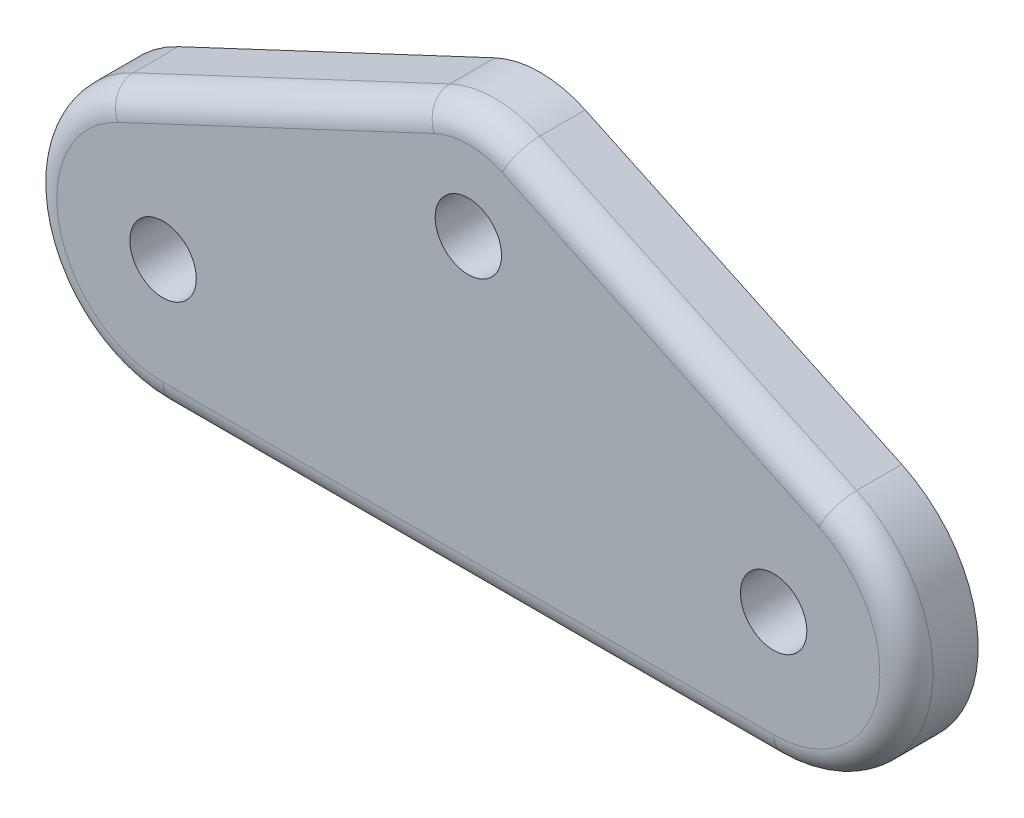
ISO-10303-21;
HEADER;
FILE_DESCRIPTION(('STEP AP214'),'2;1');
FILE_NAME('part.step','',(''),(''),'','','');
FILE_SCHEMA(('AUTOMOTIVE_DESIGN { 1 0 10303 214 1 1 1 1 }'));
ENDSEC;
DATA;
#1=APPLICATION_CONTEXT('core data for automotive mechanical design processes');
#2=APPLICATION_PROTOCOL_DEFINITION('international standard','automotive_design',2000,#1);
#3=PRODUCT_CONTEXT('',#1,'mechanical');
#4=PRODUCT('Part','Part','',(#3));
#5=PRODUCT_RELATED_PRODUCT_CATEGORY('part','',(#4));
#6=PRODUCT_DEFINITION_FORMATION('','',#4);
#7=PRODUCT_DEFINITION_CONTEXT('part definition',#1,'design');
#8=PRODUCT_DEFINITION('design','',#6,#7);
#9=PRODUCT_DEFINITION_SHAPE('','',#8);
#10=(LENGTH_UNIT() NAMED_UNIT(*) SI_UNIT(.MILLI.,.METRE.));
#11=(NAMED_UNIT(*) PLANE_ANGLE_UNIT() SI_UNIT($,.RADIAN.));
#12=(NAMED_UNIT(*) SI_UNIT($,.STERADIAN.) SOLID_ANGLE_UNIT());
#13=UNCERTAINTY_MEASURE_WITH_UNIT(LENGTH_MEASURE(1.E-05),#10,'distance_accuracy_value','');
#14=(GEOMETRIC_REPRESENTATION_CONTEXT(3) GLOBAL_UNCERTAINTY_ASSIGNED_CONTEXT((#13)) GLOBAL_UNIT_ASSIGNED_CONTEXT((#10,
#11,#12)) REPRESENTATION_CONTEXT('',''));
#15=CARTESIAN_POINT('',(0.,0.,0.));
#16=DIRECTION('',(0.,0.,1.));
#17=DIRECTION('',(1.,0.,0.));
#18=AXIS2_PLACEMENT_3D('',#15,#16,#17);
#19=CARTESIAN_POINT('',(-14.5937242344204,0.,3.429));
#20=DIRECTION('',(0.,0.,-1.));
#21=DIRECTION('',(-1.,0.,0.));
#22=AXIS2_PLACEMENT_3D('',#19,#20,#21);
#23=CYLINDRICAL_SURFACE('',#22,6.35);
#24=DIRECTION('',(0.,0.,-1.));
#25=VECTOR('',#24,1.);
#26=CARTESIAN_POINT('',(-14.5937242344204,-6.35,3.429));
#27=LINE('',#26,#25);
#28=CARTESIAN_POINT('',(-14.5937242344204,-6.35,2.159));
#29=VERTEX_POINT('',#28);
#30=CARTESIAN_POINT('',(-14.5937242344204,-6.35,0.));
#31=VERTEX_POINT('',#30);
#32=EDGE_CURVE('E102',#29,#31,#27,.T.);
#33=ORIENTED_EDGE('',*,*,#32,.F.);
#34=CARTESIAN_POINT('',(-14.5937242344204,0.,2.159));
#35=DIRECTION('',(0.,0.,1.));
#36=DIRECTION('',(1.,0.,0.));
#37=AXIS2_PLACEMENT_3D('',#34,#35,#36);
#38=CIRCLE('',#37,6.35);
#39=CARTESIAN_POINT('',(-17.2924874025021,5.74797158679526,2.159));
#40=VERTEX_POINT('',#39);
#41=EDGE_CURVE('E41',#29,#40,#38,.F.);
#42=ORIENTED_EDGE('',*,*,#41,.T.);
#43=DIRECTION('',(0.,0.,-1.));
#44=VECTOR('',#43,1.);
#45=CARTESIAN_POINT('',(-17.2924874025021,5.74797158679526,3.429));
#46=LINE('',#45,#44);
#47=CARTESIAN_POINT('',(-17.2924874025021,5.74797158679526,0.));
#48=VERTEX_POINT('',#47);
#49=EDGE_CURVE('E121',#40,#48,#46,.T.);
#50=ORIENTED_EDGE('',*,*,#49,.T.);
#51=CARTESIAN_POINT('',(-14.5937242344204,0.,0.));
#52=DIRECTION('',(0.,0.,1.));
#53=DIRECTION('',(1.,0.,0.));
#54=AXIS2_PLACEMENT_3D('',#51,#52,#53);
#55=CIRCLE('',#54,6.35);
#56=EDGE_CURVE('E116',#48,#31,#55,.T.);
#57=ORIENTED_EDGE('',*,*,#56,.T.);
#58=EDGE_LOOP('',(#33,#42,#50,#57));
#59=FACE_BOUND('',#58,.T.);
#60=ADVANCED_FACE('F32',(#59),#23,.T.);
#61=CARTESIAN_POINT('',(14.5937242344204,-6.35,3.429));
#62=DIRECTION('',(0.,1.,0.));
#63=DIRECTION('',(0.,0.,1.));
#64=AXIS2_PLACEMENT_3D('',#61,#62,#63);
#65=PLANE('',#64);
#66=DIRECTION('',(0.,0.,-1.));
#67=VECTOR('',#66,1.);
#68=CARTESIAN_POINT('',(14.5937242344204,-6.35,3.429));
#69=LINE('',#68,#67);
#70=CARTESIAN_POINT('',(14.5937242344204,-6.35,2.159));
#71=VERTEX_POINT('',#70);
#72=CARTESIAN_POINT('',(14.5937242344204,-6.35,0.));
#73=VERTEX_POINT('',#72);
#74=EDGE_CURVE('E110',#71,#73,#69,.T.);
#75=ORIENTED_EDGE('',*,*,#74,.F.);
#76=DIRECTION('',(1.,0.,0.));
#77=VECTOR('',#76,1.);
#78=CARTESIAN_POINT('',(-14.5937242344204,-6.35,2.159));
#79=LINE('',#78,#77);
#80=EDGE_CURVE('E56',#71,#29,#79,.F.);
#81=ORIENTED_EDGE('',*,*,#80,.T.);
#82=ORIENTED_EDGE('',*,*,#32,.T.);
#83=DIRECTION('',(1.,0.,0.));
#84=VECTOR('',#83,1.);
#85=CARTESIAN_POINT('',(14.5937242344204,-6.35,0.));
#86=LINE('',#85,#84);
#87=EDGE_CURVE('E105',#31,#73,#86,.T.);
#88=ORIENTED_EDGE('',*,*,#87,.T.);
#89=EDGE_LOOP('',(#75,#81,#82,#88));
#90=FACE_BOUND('',#89,.T.);
#91=ADVANCED_FACE('F104',(#90),#65,.F.);
#92=CARTESIAN_POINT('',(14.5937242344204,0.,3.429));
#93=DIRECTION('',(0.,0.,-1.));
#94=DIRECTION('',(-1.,0.,0.));
#95=AXIS2_PLACEMENT_3D('',#92,#93,#94);
#96=CYLINDRICAL_SURFACE('',#95,6.35);
#97=DIRECTION('',(0.,0.,-1.));
#98=VECTOR('',#97,1.);
#99=CARTESIAN_POINT('',(17.2924874025021,5.74797158679526,3.429));
#100=LINE('',#99,#98);
#101=CARTESIAN_POINT('',(17.2924874025021,5.74797158679526,2.159));
#102=VERTEX_POINT('',#101);
#103=CARTESIAN_POINT('',(17.2924874025021,5.74797158679526,0.));
#104=VERTEX_POINT('',#103);
#105=EDGE_CURVE('E144',#102,#104,#100,.T.);
#106=ORIENTED_EDGE('',*,*,#105,.F.);
#107=CARTESIAN_POINT('',(14.5937242344204,0.,2.159));
#108=DIRECTION('',(0.,0.,1.));
#109=DIRECTION('',(1.,0.,0.));
#110=AXIS2_PLACEMENT_3D('',#107,#108,#109);
#111=CIRCLE('',#110,6.35);
#112=EDGE_CURVE('E164',#102,#71,#111,.F.);
#113=ORIENTED_EDGE('',*,*,#112,.T.);
#114=ORIENTED_EDGE('',*,*,#74,.T.);
#115=CARTESIAN_POINT('',(14.5937242344204,0.,0.));
#116=DIRECTION('',(0.,0.,1.));
#117=DIRECTION('',(1.,0.,0.));
#118=AXIS2_PLACEMENT_3D('',#115,#116,#117);
#119=CIRCLE('',#118,6.35);
#120=EDGE_CURVE('E119',#73,#104,#119,.T.);
#121=ORIENTED_EDGE('',*,*,#120,.T.);
#122=EDGE_LOOP('',(#106,#113,#114,#121));
#123=FACE_BOUND('',#122,.T.);
#124=ADVANCED_FACE('F215',(#123),#96,.T.);
#125=CARTESIAN_POINT('',(2.15901053446535,12.8533772694362,3.429));
#126=DIRECTION('',(-0.425002073713651,-0.90519237587327,0.));
#127=DIRECTION('',(0.90519237587327,-0.425002073713651,0.));
#128=AXIS2_PLACEMENT_3D('',#125,#126,#127);
#129=PLANE('',#128);
#130=DIRECTION('',(0.,0.,-1.));
#131=VECTOR('',#130,1.);
#132=CARTESIAN_POINT('',(2.15901053446535,12.8533772694362,3.429));
#133=LINE('',#132,#131);
#134=CARTESIAN_POINT('',(2.15901053446535,12.8533772694362,2.159));
#135=VERTEX_POINT('',#134);
#136=CARTESIAN_POINT('',(2.15901053446535,12.8533772694362,0.));
#137=VERTEX_POINT('',#136);
#138=EDGE_CURVE('E142',#135,#137,#133,.T.);
#139=ORIENTED_EDGE('',*,*,#138,.F.);
#140=DIRECTION('',(-0.90519237587327,0.425002073713651,0.));
#141=VECTOR('',#140,1.);
#142=CARTESIAN_POINT('',(17.2924874025021,5.74797158679526,2.159));
#143=LINE('',#142,#141);
#144=EDGE_CURVE('E162',#135,#102,#143,.F.);
#145=ORIENTED_EDGE('',*,*,#144,.T.);
#146=ORIENTED_EDGE('',*,*,#105,.T.);
#147=DIRECTION('',(-0.90519237587327,0.425002073713651,0.));
#148=VECTOR('',#147,1.);
#149=CARTESIAN_POINT('',(2.15901053446535,12.8533772694362,0.));
#150=LINE('',#149,#148);
#151=EDGE_CURVE('E131',#104,#137,#150,.T.);
#152=ORIENTED_EDGE('',*,*,#151,.T.);
#153=EDGE_LOOP('',(#139,#145,#146,#152));
#154=FACE_BOUND('',#153,.T.);
#155=ADVANCED_FACE('F212',(#154),#129,.F.);
#156=CARTESIAN_POINT('',(0.,8.255,3.429));
#157=DIRECTION('',(0.,0.,-1.));
#158=DIRECTION('',(-1.,0.,0.));
#159=AXIS2_PLACEMENT_3D('',#156,#157,#158);
#160=CYLINDRICAL_SURFACE('',#159,5.08);
#161=DIRECTION('',(0.,0.,-1.));
#162=VECTOR('',#161,1.);
#163=CARTESIAN_POINT('',(-2.15901053446535,12.8533772694362,3.429));
#164=LINE('',#163,#162);
#165=CARTESIAN_POINT('',(-2.15901053446535,12.8533772694362,2.159));
#166=VERTEX_POINT('',#165);
#167=CARTESIAN_POINT('',(-2.15901053446535,12.8533772694362,0.));
#168=VERTEX_POINT('',#167);
#169=EDGE_CURVE('E140',#166,#168,#164,.T.);
#170=ORIENTED_EDGE('',*,*,#169,.F.);
#171=CARTESIAN_POINT('',(0.,8.255,2.159));
#172=DIRECTION('',(0.,0.,1.));
#173=DIRECTION('',(1.,0.,0.));
#174=AXIS2_PLACEMENT_3D('',#171,#172,#173);
#175=CIRCLE('',#174,5.08);
#176=EDGE_CURVE('E159',#166,#135,#175,.F.);
#177=ORIENTED_EDGE('',*,*,#176,.T.);
#178=ORIENTED_EDGE('',*,*,#138,.T.);
#179=CARTESIAN_POINT('',(0.,8.255,0.));
#180=DIRECTION('',(0.,0.,1.));
#181=DIRECTION('',(-1.,0.,0.));
#182=AXIS2_PLACEMENT_3D('',#179,#180,#181);
#183=CIRCLE('',#182,5.08);
#184=EDGE_CURVE('E134',#137,#168,#183,.T.);
#185=ORIENTED_EDGE('',*,*,#184,.T.);
#186=EDGE_LOOP('',(#170,#177,#178,#185));
#187=FACE_BOUND('',#186,.T.);
#188=ADVANCED_FACE('F200',(#187),#160,.T.);
#189=CARTESIAN_POINT('',(-17.2924874025021,5.74797158679526,3.429));
#190=DIRECTION('',(0.425002073713651,-0.90519237587327,0.));
#191=DIRECTION('',(0.90519237587327,0.425002073713651,0.));
#192=AXIS2_PLACEMENT_3D('',#189,#190,#191);
#193=PLANE('',#192);
#194=ORIENTED_EDGE('',*,*,#49,.F.);
#195=DIRECTION('',(-0.90519237587327,-0.425002073713651,0.));
#196=VECTOR('',#195,1.);
#197=CARTESIAN_POINT('',(-2.15901053446535,12.8533772694362,2.159));
#198=LINE('',#197,#196);
#199=EDGE_CURVE('E11',#40,#166,#198,.F.);
#200=ORIENTED_EDGE('',*,*,#199,.T.);
#201=ORIENTED_EDGE('',*,*,#169,.T.);
#202=DIRECTION('',(-0.90519237587327,-0.425002073713651,0.));
#203=VECTOR('',#202,1.);
#204=CARTESIAN_POINT('',(-17.2924874025021,5.74797158679526,0.));
#205=LINE('',#204,#203);
#206=EDGE_CURVE('E137',#168,#48,#205,.T.);
#207=ORIENTED_EDGE('',*,*,#206,.T.);
#208=EDGE_LOOP('',(#194,#200,#201,#207));
#209=FACE_BOUND('',#208,.T.);
#210=ADVANCED_FACE('F197',(#209),#193,.F.);
#211=CARTESIAN_POINT('',(-14.5937242344204,0.,3.429));
#212=DIRECTION('',(0.,0.,1.));
#213=DIRECTION('',(1.,0.,0.));
#214=AXIS2_PLACEMENT_3D('',#211,#212,#213);
#215=PLANE('',#214);
#216=CARTESIAN_POINT('',(0.,8.255,3.429));
#217=DIRECTION('',(0.,0.,1.));
#218=DIRECTION('',(1.,0.,0.));
#219=AXIS2_PLACEMENT_3D('',#216,#217,#218);
#220=CIRCLE('',#219,1.5875);
#221=CARTESIAN_POINT('',(1.5875,8.255,3.429));
#222=VERTEX_POINT('',#221);
#223=EDGE_CURVE('E363',#222,#222,#220,.T.);
#224=ORIENTED_EDGE('',*,*,#223,.F.);
#225=EDGE_LOOP('',(#224));
#226=FACE_BOUND('',#225,.T.);
#227=CARTESIAN_POINT('',(-14.5937242344204,0.,3.429));
#228=DIRECTION('',(0.,0.,1.));
#229=DIRECTION('',(1.,0.,0.));
#230=AXIS2_PLACEMENT_3D('',#227,#228,#229);
#231=CIRCLE('',#230,1.5875);
#232=CARTESIAN_POINT('',(-13.0062242344204,0.,3.429));
#233=VERTEX_POINT('',#232);
#234=EDGE_CURVE('E367',#233,#233,#231,.T.);
#235=ORIENTED_EDGE('',*,*,#234,.F.);
#236=EDGE_LOOP('',(#235));
#237=FACE_BOUND('',#236,.T.);
#238=CARTESIAN_POINT('',(14.5937242344204,0.,3.429));
#239=DIRECTION('',(0.,0.,1.));
#240=DIRECTION('',(1.,0.,0.));
#241=AXIS2_PLACEMENT_3D('',#238,#239,#240);
#242=CIRCLE('',#241,1.5875);
#243=CARTESIAN_POINT('',(16.1812242344204,0.,3.429));
#244=VERTEX_POINT('',#243);
#245=EDGE_CURVE('E370',#244,#244,#242,.T.);
#246=ORIENTED_EDGE('',*,*,#245,.F.);
#247=EDGE_LOOP('',(#246));
#248=FACE_BOUND('',#247,.T.);
#249=DIRECTION('',(-0.90519237587327,0.425002073713651,0.));
#250=VECTOR('',#249,1.);
#251=CARTESIAN_POINT('',(1.61925790084901,11.7037829520772,3.429));
#252=LINE('',#251,#250);
#253=CARTESIAN_POINT('',(16.7527347688858,4.59837726943621,3.429));
#254=VERTEX_POINT('',#253);
#255=CARTESIAN_POINT('',(1.61925790084901,11.7037829520772,3.429));
#256=VERTEX_POINT('',#255);
#257=EDGE_CURVE('E154',#254,#256,#252,.T.);
#258=ORIENTED_EDGE('',*,*,#257,.T.);
#259=CARTESIAN_POINT('',(0.,8.255,3.429));
#260=DIRECTION('',(0.,0.,1.));
#261=DIRECTION('',(1.,0.,0.));
#262=AXIS2_PLACEMENT_3D('',#259,#260,#261);
#263=CIRCLE('',#262,3.81);
#264=CARTESIAN_POINT('',(-1.61925790084901,11.7037829520772,3.429));
#265=VERTEX_POINT('',#264);
#266=EDGE_CURVE('E156',#256,#265,#263,.T.);
#267=ORIENTED_EDGE('',*,*,#266,.T.);
#268=DIRECTION('',(-0.90519237587327,-0.425002073713651,0.));
#269=VECTOR('',#268,1.);
#270=CARTESIAN_POINT('',(-16.7527347688858,4.59837726943621,3.429));
#271=LINE('',#270,#269);
#272=CARTESIAN_POINT('',(-16.7527347688858,4.59837726943621,3.429));
#273=VERTEX_POINT('',#272);
#274=EDGE_CURVE('E109',#265,#273,#271,.T.);
#275=ORIENTED_EDGE('',*,*,#274,.T.);
#276=CARTESIAN_POINT('',(-14.5937242344204,0.,3.429));
#277=DIRECTION('',(0.,0.,1.));
#278=DIRECTION('',(1.,0.,0.));
#279=AXIS2_PLACEMENT_3D('',#276,#277,#278);
#280=CIRCLE('',#279,5.08);
#281=CARTESIAN_POINT('',(-14.5937242344204,-5.08,3.429));
#282=VERTEX_POINT('',#281);
#283=EDGE_CURVE('E148',#273,#282,#280,.T.);
#284=ORIENTED_EDGE('',*,*,#283,.T.);
#285=DIRECTION('',(1.,0.,0.));
#286=VECTOR('',#285,1.);
#287=CARTESIAN_POINT('',(14.5937242344204,-5.08,3.429));
#288=LINE('',#287,#286);
#289=CARTESIAN_POINT('',(14.5937242344204,-5.08,3.429));
#290=VERTEX_POINT('',#289);
#291=EDGE_CURVE('E150',#282,#290,#288,.T.);
#292=ORIENTED_EDGE('',*,*,#291,.T.);
#293=CARTESIAN_POINT('',(14.5937242344204,0.,3.429));
#294=DIRECTION('',(0.,0.,1.));
#295=DIRECTION('',(1.,0.,0.));
#296=AXIS2_PLACEMENT_3D('',#293,#294,#295);
#297=CIRCLE('',#296,5.08);
#298=EDGE_CURVE('E152',#290,#254,#297,.T.);
#299=ORIENTED_EDGE('',*,*,#298,.T.);
#300=EDGE_LOOP('',(#258,#267,#275,#284,#292,#299));
#301=FACE_BOUND('',#300,.T.);
#302=ADVANCED_FACE('F187',(#226,#237,#248,#301),#215,.T.);
#303=CARTESIAN_POINT('',(-14.5937242344204,0.,0.));
#304=DIRECTION('',(0.,0.,1.));
#305=DIRECTION('',(1.,0.,0.));
#306=AXIS2_PLACEMENT_3D('',#303,#304,#305);
#307=PLANE('',#306);
#308=CARTESIAN_POINT('',(0.,8.255,0.));
#309=DIRECTION('',(0.,0.,1.));
#310=DIRECTION('',(1.,0.,0.));
#311=AXIS2_PLACEMENT_3D('',#308,#309,#310);
#312=CIRCLE('',#311,1.5875);
#313=CARTESIAN_POINT('',(1.5875,8.255,0.));
#314=VERTEX_POINT('',#313);
#315=EDGE_CURVE('E378',#314,#314,#312,.T.);
#316=ORIENTED_EDGE('',*,*,#315,.T.);
#317=EDGE_LOOP('',(#316));
#318=FACE_BOUND('',#317,.T.);
#319=CARTESIAN_POINT('',(-14.5937242344204,0.,0.));
#320=DIRECTION('',(0.,0.,1.));
#321=DIRECTION('',(1.,0.,0.));
#322=AXIS2_PLACEMENT_3D('',#319,#320,#321);
#323=CIRCLE('',#322,1.5875);
#324=CARTESIAN_POINT('',(-13.0062242344204,0.,0.));
#325=VERTEX_POINT('',#324);
#326=EDGE_CURVE('E372',#325,#325,#323,.T.);
#327=ORIENTED_EDGE('',*,*,#326,.T.);
#328=EDGE_LOOP('',(#327));
#329=FACE_BOUND('',#328,.T.);
#330=CARTESIAN_POINT('',(14.5937242344204,0.,0.));
#331=DIRECTION('',(0.,0.,1.));
#332=DIRECTION('',(1.,0.,0.));
#333=AXIS2_PLACEMENT_3D('',#330,#331,#332);
#334=CIRCLE('',#333,1.5875);
#335=CARTESIAN_POINT('',(16.1812242344204,0.,0.));
#336=VERTEX_POINT('',#335);
#337=EDGE_CURVE('E127',#336,#336,#334,.T.);
#338=ORIENTED_EDGE('',*,*,#337,.T.);
#339=EDGE_LOOP('',(#338));
#340=FACE_BOUND('',#339,.T.);
#341=ORIENTED_EDGE('',*,*,#56,.F.);
#342=ORIENTED_EDGE('',*,*,#206,.F.);
#343=ORIENTED_EDGE('',*,*,#184,.F.);
#344=ORIENTED_EDGE('',*,*,#151,.F.);
#345=ORIENTED_EDGE('',*,*,#120,.F.);
#346=ORIENTED_EDGE('',*,*,#87,.F.);
#347=EDGE_LOOP('',(#341,#342,#343,#344,#345,#346));
#348=FACE_BOUND('',#347,.T.);
#349=ADVANCED_FACE('F114',(#318,#329,#340,#348),#307,.F.);
#350=CARTESIAN_POINT('',(-14.5937242344204,-5.08,2.159));
#351=DIRECTION('',(-1.,0.,0.));
#352=DIRECTION('',(0.,0.,1.));
#353=AXIS2_PLACEMENT_3D('',#350,#351,#352);
#354=CYLINDRICAL_SURFACE('',#353,1.27);
#355=CARTESIAN_POINT('',(-14.5937242344204,-5.08,2.159));
#356=DIRECTION('',(-1.,0.,0.));
#357=DIRECTION('',(0.,0.,1.));
#358=AXIS2_PLACEMENT_3D('',#355,#356,#357);
#359=CIRCLE('',#358,1.27);
#360=EDGE_CURVE('E125',#29,#282,#359,.T.);
#361=ORIENTED_EDGE('',*,*,#360,.F.);
#362=ORIENTED_EDGE('',*,*,#80,.F.);
#363=CARTESIAN_POINT('',(14.5937242344204,-5.08,2.159));
#364=DIRECTION('',(1.,0.,0.));
#365=DIRECTION('',(0.,0.,-1.));
#366=AXIS2_PLACEMENT_3D('',#363,#364,#365);
#367=CIRCLE('',#366,1.27);
#368=EDGE_CURVE('E36',#290,#71,#367,.T.);
#369=ORIENTED_EDGE('',*,*,#368,.F.);
#370=ORIENTED_EDGE('',*,*,#291,.F.);
#371=EDGE_LOOP('',(#361,#362,#369,#370));
#372=FACE_BOUND('',#371,.T.);
#373=ADVANCED_FACE('F34',(#372),#354,.T.);
#374=CARTESIAN_POINT('',(14.5937242344204,0.,2.159));
#375=DIRECTION('',(0.,0.,1.));
#376=DIRECTION('',(1.,0.,0.));
#377=AXIS2_PLACEMENT_3D('',#374,#375,#376);
#378=TOROIDAL_SURFACE('',#377,5.08,1.27);
#379=ORIENTED_EDGE('',*,*,#368,.T.);
#380=ORIENTED_EDGE('',*,*,#112,.F.);
#381=CARTESIAN_POINT('',(16.7527347688858,4.59837726943621,2.159));
#382=DIRECTION('',(-0.90519237587327,0.425002073713652,0.));
#383=DIRECTION('',(-0.425002073713652,-0.90519237587327,0.));
#384=AXIS2_PLACEMENT_3D('',#381,#382,#383);
#385=CIRCLE('',#384,1.27);
#386=EDGE_CURVE('E175',#254,#102,#385,.T.);
#387=ORIENTED_EDGE('',*,*,#386,.F.);
#388=ORIENTED_EDGE('',*,*,#298,.F.);
#389=EDGE_LOOP('',(#379,#380,#387,#388));
#390=FACE_BOUND('',#389,.T.);
#391=ADVANCED_FACE('F217',(#390),#378,.T.);
#392=CARTESIAN_POINT('',(-14.5937242344204,0.,2.159));
#393=DIRECTION('',(0.,0.,1.));
#394=DIRECTION('',(1.,0.,0.));
#395=AXIS2_PLACEMENT_3D('',#392,#393,#394);
#396=TOROIDAL_SURFACE('',#395,5.08,1.27);
#397=ORIENTED_EDGE('',*,*,#360,.T.);
#398=ORIENTED_EDGE('',*,*,#283,.F.);
#399=CARTESIAN_POINT('',(-16.7527347688858,4.59837726943621,2.159));
#400=DIRECTION('',(0.90519237587327,0.425002073713652,0.));
#401=DIRECTION('',(-0.425002073713652,0.90519237587327,0.));
#402=AXIS2_PLACEMENT_3D('',#399,#400,#401);
#403=CIRCLE('',#402,1.27);
#404=EDGE_CURVE('E172',#40,#273,#403,.T.);
#405=ORIENTED_EDGE('',*,*,#404,.F.);
#406=ORIENTED_EDGE('',*,*,#41,.F.);
#407=EDGE_LOOP('',(#397,#398,#405,#406));
#408=FACE_BOUND('',#407,.T.);
#409=ADVANCED_FACE('F180',(#408),#396,.T.);
#410=CARTESIAN_POINT('',(-7.16267937269639,15.8270407831866,2.159));
#411=DIRECTION('',(0.90519237587327,-0.425002073713651,0.));
#412=DIRECTION('',(0.425002073713651,0.90519237587327,0.));
#413=AXIS2_PLACEMENT_3D('',#410,#411,#412);
#414=CYLINDRICAL_SURFACE('',#413,1.27);
#415=ORIENTED_EDGE('',*,*,#386,.T.);
#416=ORIENTED_EDGE('',*,*,#144,.F.);
#417=CARTESIAN_POINT('',(1.61925790084901,11.7037829520772,2.159));
#418=DIRECTION('',(-0.905192375873271,0.425002073713651,0.));
#419=DIRECTION('',(-0.425002073713651,-0.905192375873271,0.));
#420=AXIS2_PLACEMENT_3D('',#417,#418,#419);
#421=CIRCLE('',#420,1.27);
#422=EDGE_CURVE('E170',#256,#135,#421,.T.);
#423=ORIENTED_EDGE('',*,*,#422,.F.);
#424=ORIENTED_EDGE('',*,*,#257,.F.);
#425=EDGE_LOOP('',(#415,#416,#423,#424));
#426=FACE_BOUND('',#425,.T.);
#427=ADVANCED_FACE('F209',(#426),#414,.T.);
#428=CARTESIAN_POINT('',(-16.7527347688858,4.59837726943621,2.159));
#429=DIRECTION('',(0.90519237587327,0.425002073713651,0.));
#430=DIRECTION('',(-0.425002073713651,0.90519237587327,0.));
#431=AXIS2_PLACEMENT_3D('',#428,#429,#430);
#432=CYLINDRICAL_SURFACE('',#431,1.27);
#433=ORIENTED_EDGE('',*,*,#404,.T.);
#434=ORIENTED_EDGE('',*,*,#274,.F.);
#435=CARTESIAN_POINT('',(-1.61925790084901,11.7037829520772,2.159));
#436=DIRECTION('',(0.90519237587327,0.425002073713651,0.));
#437=DIRECTION('',(-0.425002073713651,0.905192375873271,0.));
#438=AXIS2_PLACEMENT_3D('',#435,#436,#437);
#439=CIRCLE('',#438,1.27);
#440=EDGE_CURVE('E168',#166,#265,#439,.T.);
#441=ORIENTED_EDGE('',*,*,#440,.F.);
#442=ORIENTED_EDGE('',*,*,#199,.F.);
#443=EDGE_LOOP('',(#433,#434,#441,#442));
#444=FACE_BOUND('',#443,.T.);
#445=ADVANCED_FACE('F193',(#444),#432,.T.);
#446=CARTESIAN_POINT('',(0.,8.255,2.159));
#447=DIRECTION('',(0.,0.,1.));
#448=DIRECTION('',(1.,0.,0.));
#449=AXIS2_PLACEMENT_3D('',#446,#447,#448);
#450=TOROIDAL_SURFACE('',#449,3.81,1.27);
#451=ORIENTED_EDGE('',*,*,#422,.T.);
#452=ORIENTED_EDGE('',*,*,#176,.F.);
#453=ORIENTED_EDGE('',*,*,#440,.T.);
#454=ORIENTED_EDGE('',*,*,#266,.F.);
#455=EDGE_LOOP('',(#451,#452,#453,#454));
#456=FACE_BOUND('',#455,.T.);
#457=ADVANCED_FACE('F204',(#456),#450,.T.);
#458=CARTESIAN_POINT('',(14.5937242344204,0.,3.429));
#459=DIRECTION('',(0.,0.,1.));
#460=DIRECTION('',(1.,0.,0.));
#461=AXIS2_PLACEMENT_3D('',#458,#459,#460);
#462=CYLINDRICAL_SURFACE('',#461,1.5875);
#463=ORIENTED_EDGE('',*,*,#337,.F.);
#464=EDGE_LOOP('',(#463));
#465=FACE_BOUND('',#464,.T.);
#466=ORIENTED_EDGE('',*,*,#245,.T.);
#467=EDGE_LOOP('',(#466));
#468=FACE_BOUND('',#467,.T.);
#469=ADVANCED_FACE('F234',(#465,#468),#462,.F.);
#470=CARTESIAN_POINT('',(-14.5937242344204,0.,3.429));
#471=DIRECTION('',(0.,0.,1.));
#472=DIRECTION('',(1.,0.,0.));
#473=AXIS2_PLACEMENT_3D('',#470,#471,#472);
#474=CYLINDRICAL_SURFACE('',#473,1.5875);
#475=ORIENTED_EDGE('',*,*,#326,.F.);
#476=EDGE_LOOP('',(#475));
#477=FACE_BOUND('',#476,.T.);
#478=ORIENTED_EDGE('',*,*,#234,.T.);
#479=EDGE_LOOP('',(#478));
#480=FACE_BOUND('',#479,.T.);
#481=ADVANCED_FACE('F257',(#477,#480),#474,.F.);
#482=CARTESIAN_POINT('',(0.,8.255,3.429));
#483=DIRECTION('',(0.,0.,1.));
#484=DIRECTION('',(1.,0.,0.));
#485=AXIS2_PLACEMENT_3D('',#482,#483,#484);
#486=CYLINDRICAL_SURFACE('',#485,1.5875);
#487=ORIENTED_EDGE('',*,*,#315,.F.);
#488=EDGE_LOOP('',(#487));
#489=FACE_BOUND('',#488,.T.);
#490=ORIENTED_EDGE('',*,*,#223,.T.);
#491=EDGE_LOOP('',(#490));
#492=FACE_BOUND('',#491,.T.);
#493=ADVANCED_FACE('F266',(#489,#492),#486,.F.);
#494=CLOSED_SHELL('',(#60,#91,#124,#155,#188,#210,#302,#349,#373,#391,#409,#427,#445,#457,#469,
#481,#493));
#495=MANIFOLD_SOLID_BREP('B2',#494);
#496=ADVANCED_BREP_SHAPE_REPRESENTATION('',(#18,#495),#14);
#497=SHAPE_DEFINITION_REPRESENTATION(#9,#496);
ENDSEC;
END-ISO-10303-21;
